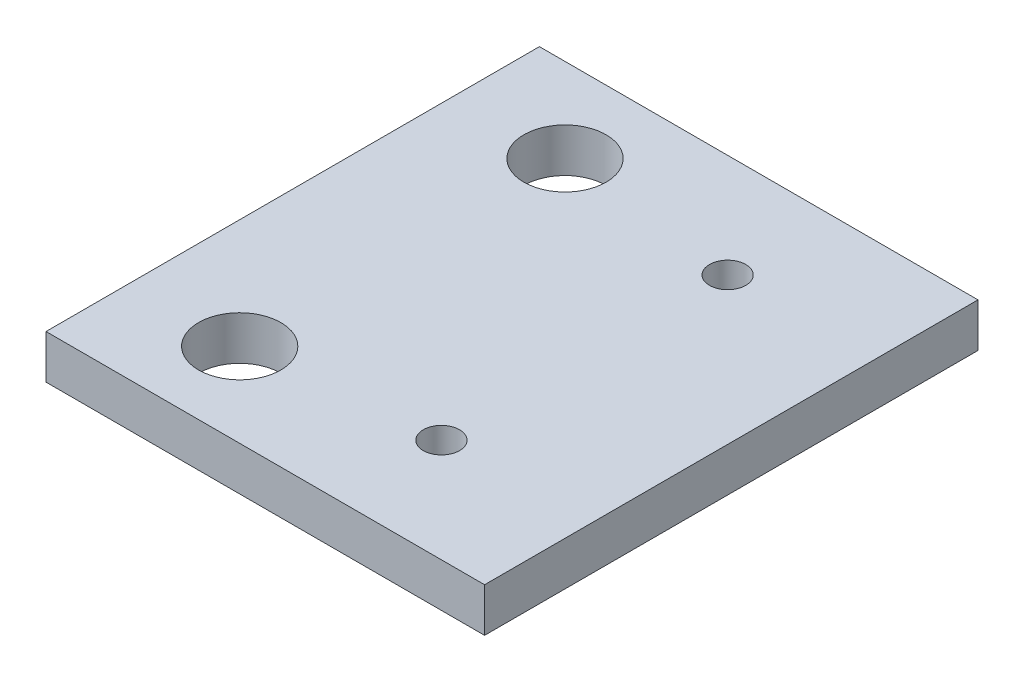
ISO-10303-21;
HEADER;
FILE_DESCRIPTION(('STEP AP214'),'2;1');
FILE_NAME('part.step','',(''),(''),'','','');
FILE_SCHEMA(('AUTOMOTIVE_DESIGN { 1 0 10303 214 1 1 1 1 }'));
ENDSEC;
DATA;
#1=APPLICATION_CONTEXT('core data for automotive mechanical design processes');
#2=APPLICATION_PROTOCOL_DEFINITION('international standard','automotive_design',2000,#1);
#3=PRODUCT_CONTEXT('',#1,'mechanical');
#4=PRODUCT('Part','Part','',(#3));
#5=PRODUCT_RELATED_PRODUCT_CATEGORY('part','',(#4));
#6=PRODUCT_DEFINITION_FORMATION('','',#4);
#7=PRODUCT_DEFINITION_CONTEXT('part definition',#1,'design');
#8=PRODUCT_DEFINITION('design','',#6,#7);
#9=PRODUCT_DEFINITION_SHAPE('','',#8);
#10=(LENGTH_UNIT() NAMED_UNIT(*) SI_UNIT(.MILLI.,.METRE.));
#11=(NAMED_UNIT(*) PLANE_ANGLE_UNIT() SI_UNIT($,.RADIAN.));
#12=(NAMED_UNIT(*) SI_UNIT($,.STERADIAN.) SOLID_ANGLE_UNIT());
#13=UNCERTAINTY_MEASURE_WITH_UNIT(LENGTH_MEASURE(1.E-05),#10,'distance_accuracy_value','');
#14=(GEOMETRIC_REPRESENTATION_CONTEXT(3) GLOBAL_UNCERTAINTY_ASSIGNED_CONTEXT((#13)) GLOBAL_UNIT_ASSIGNED_CONTEXT((#10,
#11,#12)) REPRESENTATION_CONTEXT('',''));
#15=CARTESIAN_POINT('',(0.,0.,0.));
#16=DIRECTION('',(0.,0.,1.));
#17=DIRECTION('',(1.,0.,0.));
#18=AXIS2_PLACEMENT_3D('',#15,#16,#17);
#19=CARTESIAN_POINT('',(-25.4,5.08,-28.575));
#20=DIRECTION('',(1.,0.,0.));
#21=DIRECTION('',(0.,0.,-1.));
#22=AXIS2_PLACEMENT_3D('',#19,#20,#21);
#23=PLANE('',#22);
#24=DIRECTION('',(0.,0.,1.));
#25=VECTOR('',#24,1.);
#26=CARTESIAN_POINT('',(-25.4,0.,-28.575));
#27=LINE('',#26,#25);
#28=CARTESIAN_POINT('',(-25.4,0.,-28.575));
#29=VERTEX_POINT('',#28);
#30=CARTESIAN_POINT('',(-25.4,0.,28.575));
#31=VERTEX_POINT('',#30);
#32=EDGE_CURVE('E112',#29,#31,#27,.T.);
#33=ORIENTED_EDGE('',*,*,#32,.T.);
#34=DIRECTION('',(0.,-1.,0.));
#35=VECTOR('',#34,1.);
#36=CARTESIAN_POINT('',(-25.4,5.08,28.575));
#37=LINE('',#36,#35);
#38=CARTESIAN_POINT('',(-25.4,5.08,28.575));
#39=VERTEX_POINT('',#38);
#40=EDGE_CURVE('E12',#39,#31,#37,.T.);
#41=ORIENTED_EDGE('',*,*,#40,.F.);
#42=DIRECTION('',(0.,0.,1.));
#43=VECTOR('',#42,1.);
#44=CARTESIAN_POINT('',(-25.4,5.08,-28.575));
#45=LINE('',#44,#43);
#46=CARTESIAN_POINT('',(-25.4,5.08,-28.575));
#47=VERTEX_POINT('',#46);
#48=EDGE_CURVE('E98',#47,#39,#45,.T.);
#49=ORIENTED_EDGE('',*,*,#48,.F.);
#50=DIRECTION('',(0.,-1.,0.));
#51=VECTOR('',#50,1.);
#52=CARTESIAN_POINT('',(-25.4,5.08,-28.575));
#53=LINE('',#52,#51);
#54=EDGE_CURVE('E107',#47,#29,#53,.T.);
#55=ORIENTED_EDGE('',*,*,#54,.T.);
#56=EDGE_LOOP('',(#33,#41,#49,#55));
#57=FACE_BOUND('',#56,.T.);
#58=ADVANCED_FACE('F47',(#57),#23,.F.);
#59=CARTESIAN_POINT('',(-25.4,5.08,28.575));
#60=DIRECTION('',(0.,0.,-1.));
#61=DIRECTION('',(-1.,0.,0.));
#62=AXIS2_PLACEMENT_3D('',#59,#60,#61);
#63=PLANE('',#62);
#64=DIRECTION('',(1.,0.,0.));
#65=VECTOR('',#64,1.);
#66=CARTESIAN_POINT('',(-25.4,0.,28.575));
#67=LINE('',#66,#65);
#68=CARTESIAN_POINT('',(25.4,0.,28.575));
#69=VERTEX_POINT('',#68);
#70=EDGE_CURVE('E102',#31,#69,#67,.T.);
#71=ORIENTED_EDGE('',*,*,#70,.T.);
#72=DIRECTION('',(0.,-1.,0.));
#73=VECTOR('',#72,1.);
#74=CARTESIAN_POINT('',(25.4,5.08,28.575));
#75=LINE('',#74,#73);
#76=CARTESIAN_POINT('',(25.4,5.08,28.575));
#77=VERTEX_POINT('',#76);
#78=EDGE_CURVE('E55',#77,#69,#75,.T.);
#79=ORIENTED_EDGE('',*,*,#78,.F.);
#80=DIRECTION('',(1.,0.,0.));
#81=VECTOR('',#80,1.);
#82=CARTESIAN_POINT('',(-25.4,5.08,28.575));
#83=LINE('',#82,#81);
#84=EDGE_CURVE('E93',#39,#77,#83,.T.);
#85=ORIENTED_EDGE('',*,*,#84,.F.);
#86=ORIENTED_EDGE('',*,*,#40,.T.);
#87=EDGE_LOOP('',(#71,#79,#85,#86));
#88=FACE_BOUND('',#87,.T.);
#89=ADVANCED_FACE('F101',(#88),#63,.F.);
#90=CARTESIAN_POINT('',(25.4,5.08,-28.575));
#91=DIRECTION('',(-1.,0.,0.));
#92=DIRECTION('',(0.,0.,1.));
#93=AXIS2_PLACEMENT_3D('',#90,#91,#92);
#94=PLANE('',#93);
#95=DIRECTION('',(0.,0.,-1.));
#96=VECTOR('',#95,1.);
#97=CARTESIAN_POINT('',(25.4,0.,-28.575));
#98=LINE('',#97,#96);
#99=CARTESIAN_POINT('',(25.4,0.,-28.575));
#100=VERTEX_POINT('',#99);
#101=EDGE_CURVE('E80',#69,#100,#98,.T.);
#102=ORIENTED_EDGE('',*,*,#101,.T.);
#103=DIRECTION('',(0.,-1.,0.));
#104=VECTOR('',#103,1.);
#105=CARTESIAN_POINT('',(25.4,5.08,-28.575));
#106=LINE('',#105,#104);
#107=CARTESIAN_POINT('',(25.4,5.08,-28.575));
#108=VERTEX_POINT('',#107);
#109=EDGE_CURVE('E103',#108,#100,#106,.T.);
#110=ORIENTED_EDGE('',*,*,#109,.F.);
#111=DIRECTION('',(0.,0.,-1.));
#112=VECTOR('',#111,1.);
#113=CARTESIAN_POINT('',(25.4,5.08,-28.575));
#114=LINE('',#113,#112);
#115=EDGE_CURVE('E96',#77,#108,#114,.T.);
#116=ORIENTED_EDGE('',*,*,#115,.F.);
#117=ORIENTED_EDGE('',*,*,#78,.T.);
#118=EDGE_LOOP('',(#102,#110,#116,#117));
#119=FACE_BOUND('',#118,.T.);
#120=ADVANCED_FACE('F104',(#119),#94,.F.);
#121=CARTESIAN_POINT('',(-25.4,5.08,-28.575));
#122=DIRECTION('',(0.,0.,1.));
#123=DIRECTION('',(1.,0.,0.));
#124=AXIS2_PLACEMENT_3D('',#121,#122,#123);
#125=PLANE('',#124);
#126=DIRECTION('',(-1.,0.,0.));
#127=VECTOR('',#126,1.);
#128=CARTESIAN_POINT('',(-25.4,0.,-28.575));
#129=LINE('',#128,#127);
#130=EDGE_CURVE('E86',#100,#29,#129,.T.);
#131=ORIENTED_EDGE('',*,*,#130,.T.);
#132=ORIENTED_EDGE('',*,*,#54,.F.);
#133=DIRECTION('',(-1.,0.,0.));
#134=VECTOR('',#133,1.);
#135=CARTESIAN_POINT('',(-25.4,5.08,-28.575));
#136=LINE('',#135,#134);
#137=EDGE_CURVE('E63',#108,#47,#136,.T.);
#138=ORIENTED_EDGE('',*,*,#137,.F.);
#139=ORIENTED_EDGE('',*,*,#109,.T.);
#140=EDGE_LOOP('',(#131,#132,#138,#139));
#141=FACE_BOUND('',#140,.T.);
#142=ADVANCED_FACE('F120',(#141),#125,.F.);
#143=CARTESIAN_POINT('',(0.,5.08,0.));
#144=DIRECTION('',(0.,1.,0.));
#145=DIRECTION('',(0.,0.,1.));
#146=AXIS2_PLACEMENT_3D('',#143,#144,#145);
#147=PLANE('',#146);
#148=CARTESIAN_POINT('',(8.39999999999999,5.08,-16.575));
#149=DIRECTION('',(0.,-1.,0.));
#150=DIRECTION('',(0.,0.,-1.));
#151=AXIS2_PLACEMENT_3D('',#148,#149,#150);
#152=CIRCLE('',#151,2.1);
#153=CARTESIAN_POINT('',(8.39999999999999,5.08,-18.675));
#154=VERTEX_POINT('',#153);
#155=EDGE_CURVE('E130',#154,#154,#152,.T.);
#156=ORIENTED_EDGE('',*,*,#155,.T.);
#157=EDGE_LOOP('',(#156));
#158=FACE_BOUND('',#157,.T.);
#159=CARTESIAN_POINT('',(8.4,5.08,16.575));
#160=DIRECTION('',(0.,-1.,0.));
#161=DIRECTION('',(0.,0.,-1.));
#162=AXIS2_PLACEMENT_3D('',#159,#160,#161);
#163=CIRCLE('',#162,2.1);
#164=CARTESIAN_POINT('',(8.4,5.08,14.475));
#165=VERTEX_POINT('',#164);
#166=EDGE_CURVE('E138',#165,#165,#163,.T.);
#167=ORIENTED_EDGE('',*,*,#166,.T.);
#168=EDGE_LOOP('',(#167));
#169=FACE_BOUND('',#168,.T.);
#170=CARTESIAN_POINT('',(-12.7,5.08,18.837656));
#171=DIRECTION('',(0.,1.,0.));
#172=DIRECTION('',(0.,0.,1.));
#173=AXIS2_PLACEMENT_3D('',#170,#171,#172);
#174=CIRCLE('',#173,4.7625);
#175=CARTESIAN_POINT('',(-12.7,5.08,23.600156));
#176=VERTEX_POINT('',#175);
#177=EDGE_CURVE('E133',#176,#176,#174,.T.);
#178=ORIENTED_EDGE('',*,*,#177,.F.);
#179=EDGE_LOOP('',(#178));
#180=FACE_BOUND('',#179,.T.);
#181=CARTESIAN_POINT('',(-12.7,5.08,-18.837656));
#182=DIRECTION('',(0.,1.,0.));
#183=DIRECTION('',(0.,0.,1.));
#184=AXIS2_PLACEMENT_3D('',#181,#182,#183);
#185=CIRCLE('',#184,4.7625);
#186=CARTESIAN_POINT('',(-12.7,5.08,-14.075156));
#187=VERTEX_POINT('',#186);
#188=EDGE_CURVE('E129',#187,#187,#185,.T.);
#189=ORIENTED_EDGE('',*,*,#188,.F.);
#190=EDGE_LOOP('',(#189));
#191=FACE_BOUND('',#190,.T.);
#192=ORIENTED_EDGE('',*,*,#48,.T.);
#193=ORIENTED_EDGE('',*,*,#84,.T.);
#194=ORIENTED_EDGE('',*,*,#115,.T.);
#195=ORIENTED_EDGE('',*,*,#137,.T.);
#196=EDGE_LOOP('',(#192,#193,#194,#195));
#197=FACE_BOUND('',#196,.T.);
#198=ADVANCED_FACE('F94',(#158,#169,#180,#191,#197),#147,.T.);
#199=CARTESIAN_POINT('',(0.,0.,0.));
#200=DIRECTION('',(0.,1.,0.));
#201=DIRECTION('',(0.,0.,1.));
#202=AXIS2_PLACEMENT_3D('',#199,#200,#201);
#203=PLANE('',#202);
#204=CARTESIAN_POINT('',(8.39999999999999,0.,-16.575));
#205=DIRECTION('',(0.,-1.,0.));
#206=DIRECTION('',(0.,0.,-1.));
#207=AXIS2_PLACEMENT_3D('',#204,#205,#206);
#208=CIRCLE('',#207,2.1);
#209=CARTESIAN_POINT('',(8.39999999999999,0.,-18.675));
#210=VERTEX_POINT('',#209);
#211=EDGE_CURVE('E145',#210,#210,#208,.T.);
#212=ORIENTED_EDGE('',*,*,#211,.F.);
#213=EDGE_LOOP('',(#212));
#214=FACE_BOUND('',#213,.T.);
#215=CARTESIAN_POINT('',(8.4,0.,16.575));
#216=DIRECTION('',(0.,-1.,0.));
#217=DIRECTION('',(0.,0.,-1.));
#218=AXIS2_PLACEMENT_3D('',#215,#216,#217);
#219=CIRCLE('',#218,2.1);
#220=CARTESIAN_POINT('',(8.4,0.,14.475));
#221=VERTEX_POINT('',#220);
#222=EDGE_CURVE('E142',#221,#221,#219,.T.);
#223=ORIENTED_EDGE('',*,*,#222,.F.);
#224=EDGE_LOOP('',(#223));
#225=FACE_BOUND('',#224,.T.);
#226=CARTESIAN_POINT('',(-12.7,0.,18.837656));
#227=DIRECTION('',(0.,1.,0.));
#228=DIRECTION('',(0.,0.,1.));
#229=AXIS2_PLACEMENT_3D('',#226,#227,#228);
#230=CIRCLE('',#229,4.7625);
#231=CARTESIAN_POINT('',(-12.7,0.,23.600156));
#232=VERTEX_POINT('',#231);
#233=EDGE_CURVE('E115',#232,#232,#230,.T.);
#234=ORIENTED_EDGE('',*,*,#233,.T.);
#235=EDGE_LOOP('',(#234));
#236=FACE_BOUND('',#235,.T.);
#237=CARTESIAN_POINT('',(-12.7,0.,-18.837656));
#238=DIRECTION('',(0.,1.,0.));
#239=DIRECTION('',(0.,0.,1.));
#240=AXIS2_PLACEMENT_3D('',#237,#238,#239);
#241=CIRCLE('',#240,4.7625);
#242=CARTESIAN_POINT('',(-12.7,0.,-14.075156));
#243=VERTEX_POINT('',#242);
#244=EDGE_CURVE('E126',#243,#243,#241,.T.);
#245=ORIENTED_EDGE('',*,*,#244,.T.);
#246=EDGE_LOOP('',(#245));
#247=FACE_BOUND('',#246,.T.);
#248=ORIENTED_EDGE('',*,*,#32,.F.);
#249=ORIENTED_EDGE('',*,*,#130,.F.);
#250=ORIENTED_EDGE('',*,*,#101,.F.);
#251=ORIENTED_EDGE('',*,*,#70,.F.);
#252=EDGE_LOOP('',(#248,#249,#250,#251));
#253=FACE_BOUND('',#252,.T.);
#254=ADVANCED_FACE('F123',(#214,#225,#236,#247,#253),#203,.F.);
#255=CARTESIAN_POINT('',(-12.7,0.,-18.837656));
#256=DIRECTION('',(0.,1.,0.));
#257=DIRECTION('',(0.,0.,1.));
#258=AXIS2_PLACEMENT_3D('',#255,#256,#257);
#259=CYLINDRICAL_SURFACE('',#258,4.7625);
#260=ORIENTED_EDGE('',*,*,#244,.F.);
#261=EDGE_LOOP('',(#260));
#262=FACE_BOUND('',#261,.T.);
#263=ORIENTED_EDGE('',*,*,#188,.T.);
#264=EDGE_LOOP('',(#263));
#265=FACE_BOUND('',#264,.T.);
#266=ADVANCED_FACE('F162',(#262,#265),#259,.F.);
#267=CARTESIAN_POINT('',(-12.7,0.,18.837656));
#268=DIRECTION('',(0.,1.,0.));
#269=DIRECTION('',(0.,0.,1.));
#270=AXIS2_PLACEMENT_3D('',#267,#268,#269);
#271=CYLINDRICAL_SURFACE('',#270,4.7625);
#272=ORIENTED_EDGE('',*,*,#233,.F.);
#273=EDGE_LOOP('',(#272));
#274=FACE_BOUND('',#273,.T.);
#275=ORIENTED_EDGE('',*,*,#177,.T.);
#276=EDGE_LOOP('',(#275));
#277=FACE_BOUND('',#276,.T.);
#278=ADVANCED_FACE('F172',(#274,#277),#271,.F.);
#279=CARTESIAN_POINT('',(8.4,5.08,16.575));
#280=DIRECTION('',(0.,-1.,0.));
#281=DIRECTION('',(0.,0.,-1.));
#282=AXIS2_PLACEMENT_3D('',#279,#280,#281);
#283=CYLINDRICAL_SURFACE('',#282,2.1);
#284=ORIENTED_EDGE('',*,*,#166,.F.);
#285=EDGE_LOOP('',(#284));
#286=FACE_BOUND('',#285,.T.);
#287=ORIENTED_EDGE('',*,*,#222,.T.);
#288=EDGE_LOOP('',(#287));
#289=FACE_BOUND('',#288,.T.);
#290=ADVANCED_FACE('F156',(#286,#289),#283,.F.);
#291=CARTESIAN_POINT('',(8.39999999999999,5.08,-16.575));
#292=DIRECTION('',(0.,-1.,0.));
#293=DIRECTION('',(0.,0.,-1.));
#294=AXIS2_PLACEMENT_3D('',#291,#292,#293);
#295=CYLINDRICAL_SURFACE('',#294,2.1);
#296=ORIENTED_EDGE('',*,*,#155,.F.);
#297=EDGE_LOOP('',(#296));
#298=FACE_BOUND('',#297,.T.);
#299=ORIENTED_EDGE('',*,*,#211,.T.);
#300=EDGE_LOOP('',(#299));
#301=FACE_BOUND('',#300,.T.);
#302=ADVANCED_FACE('F153',(#298,#301),#295,.F.);
#303=CLOSED_SHELL('',(#58,#89,#120,#142,#198,#254,#266,#278,#290,#302));
#304=MANIFOLD_SOLID_BREP('B2',#303);
#305=ADVANCED_BREP_SHAPE_REPRESENTATION('',(#18,#304),#14);
#306=SHAPE_DEFINITION_REPRESENTATION(#9,#305);
ENDSEC;
END-ISO-10303-21;
